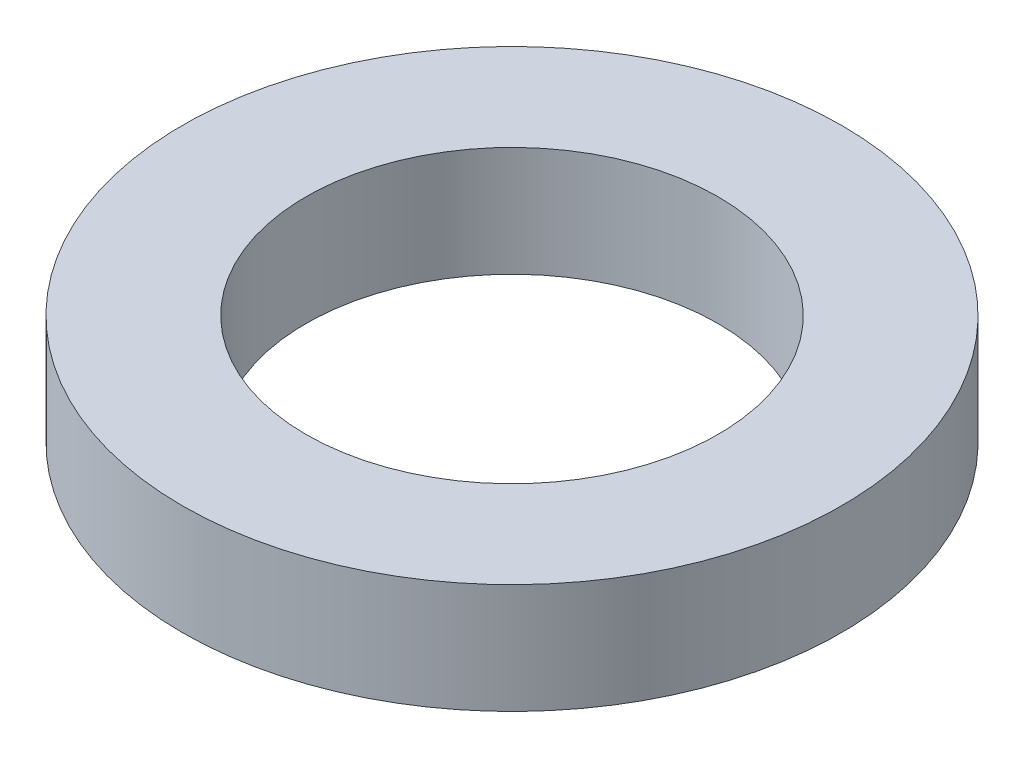
ISO-10303-21;
HEADER;
FILE_DESCRIPTION(('STEP AP214'),'2;1');
FILE_NAME('part.step','',(''),(''),'','','');
FILE_SCHEMA(('AUTOMOTIVE_DESIGN { 1 0 10303 214 1 1 1 1 }'));
ENDSEC;
DATA;
#1=APPLICATION_CONTEXT('core data for automotive mechanical design processes');
#2=APPLICATION_PROTOCOL_DEFINITION('international standard','automotive_design',2000,#1);
#3=PRODUCT_CONTEXT('',#1,'mechanical');
#4=PRODUCT('Part','Part','',(#3));
#5=PRODUCT_RELATED_PRODUCT_CATEGORY('part','',(#4));
#6=PRODUCT_DEFINITION_FORMATION('','',#4);
#7=PRODUCT_DEFINITION_CONTEXT('part definition',#1,'design');
#8=PRODUCT_DEFINITION('design','',#6,#7);
#9=PRODUCT_DEFINITION_SHAPE('','',#8);
#10=(LENGTH_UNIT() NAMED_UNIT(*) SI_UNIT(.MILLI.,.METRE.));
#11=(NAMED_UNIT(*) PLANE_ANGLE_UNIT() SI_UNIT($,.RADIAN.));
#12=(NAMED_UNIT(*) SI_UNIT($,.STERADIAN.) SOLID_ANGLE_UNIT());
#13=UNCERTAINTY_MEASURE_WITH_UNIT(LENGTH_MEASURE(1.E-05),#10,'distance_accuracy_value','');
#14=(GEOMETRIC_REPRESENTATION_CONTEXT(3) GLOBAL_UNCERTAINTY_ASSIGNED_CONTEXT((#13)) GLOBAL_UNIT_ASSIGNED_CONTEXT((#10,
#11,#12)) REPRESENTATION_CONTEXT('',''));
#15=CARTESIAN_POINT('',(0.,0.,0.));
#16=DIRECTION('',(0.,0.,1.));
#17=DIRECTION('',(1.,0.,0.));
#18=AXIS2_PLACEMENT_3D('',#15,#16,#17);
#19=CARTESIAN_POINT('',(0.,2.,0.));
#20=DIRECTION('',(0.,1.,0.));
#21=DIRECTION('',(0.,0.,1.));
#22=AXIS2_PLACEMENT_3D('',#19,#20,#21);
#23=PLANE('',#22);
#24=CARTESIAN_POINT('',(0.,2.,0.));
#25=DIRECTION('',(0.,1.,0.));
#26=DIRECTION('',(0.,0.,1.));
#27=AXIS2_PLACEMENT_3D('',#24,#25,#26);
#28=CIRCLE('',#27,6.);
#29=CARTESIAN_POINT('',(0.,2.,6.));
#30=VERTEX_POINT('',#29);
#31=EDGE_CURVE('E10',#30,#30,#28,.T.);
#32=ORIENTED_EDGE('',*,*,#31,.T.);
#33=EDGE_LOOP('',(#32));
#34=FACE_BOUND('',#33,.T.);
#35=CARTESIAN_POINT('',(0.,2.,0.));
#36=DIRECTION('',(0.,1.,0.));
#37=DIRECTION('',(0.,0.,1.));
#38=AXIS2_PLACEMENT_3D('',#35,#36,#37);
#39=CIRCLE('',#38,3.75);
#40=CARTESIAN_POINT('',(0.,2.,3.75));
#41=VERTEX_POINT('',#40);
#42=EDGE_CURVE('E42',#41,#41,#39,.T.);
#43=ORIENTED_EDGE('',*,*,#42,.F.);
#44=EDGE_LOOP('',(#43));
#45=FACE_BOUND('',#44,.T.);
#46=ADVANCED_FACE('F31',(#34,#45),#23,.T.);
#47=CARTESIAN_POINT('',(0.,0.,0.));
#48=DIRECTION('',(0.,1.,0.));
#49=DIRECTION('',(0.,0.,1.));
#50=AXIS2_PLACEMENT_3D('',#47,#48,#49);
#51=PLANE('',#50);
#52=CARTESIAN_POINT('',(0.,0.,0.));
#53=DIRECTION('',(0.,1.,0.));
#54=DIRECTION('',(0.,0.,1.));
#55=AXIS2_PLACEMENT_3D('',#52,#53,#54);
#56=CIRCLE('',#55,6.);
#57=CARTESIAN_POINT('',(0.,0.,6.));
#58=VERTEX_POINT('',#57);
#59=EDGE_CURVE('E35',#58,#58,#56,.T.);
#60=ORIENTED_EDGE('',*,*,#59,.F.);
#61=EDGE_LOOP('',(#60));
#62=FACE_BOUND('',#61,.T.);
#63=CARTESIAN_POINT('',(0.,0.,0.));
#64=DIRECTION('',(0.,1.,0.));
#65=DIRECTION('',(0.,0.,1.));
#66=AXIS2_PLACEMENT_3D('',#63,#64,#65);
#67=CIRCLE('',#66,3.75);
#68=CARTESIAN_POINT('',(0.,0.,3.75));
#69=VERTEX_POINT('',#68);
#70=EDGE_CURVE('E44',#69,#69,#67,.T.);
#71=ORIENTED_EDGE('',*,*,#70,.T.);
#72=EDGE_LOOP('',(#71));
#73=FACE_BOUND('',#72,.T.);
#74=ADVANCED_FACE('F54',(#62,#73),#51,.F.);
#75=CARTESIAN_POINT('',(0.,2.,0.));
#76=DIRECTION('',(0.,-1.,0.));
#77=DIRECTION('',(0.,0.,-1.));
#78=AXIS2_PLACEMENT_3D('',#75,#76,#77);
#79=CYLINDRICAL_SURFACE('',#78,6.);
#80=ORIENTED_EDGE('',*,*,#31,.F.);
#81=EDGE_LOOP('',(#80));
#82=FACE_BOUND('',#81,.T.);
#83=ORIENTED_EDGE('',*,*,#59,.T.);
#84=EDGE_LOOP('',(#83));
#85=FACE_BOUND('',#84,.T.);
#86=ADVANCED_FACE('F33',(#82,#85),#79,.T.);
#87=CARTESIAN_POINT('',(0.,2.,0.));
#88=DIRECTION('',(0.,-1.,0.));
#89=DIRECTION('',(0.,0.,-1.));
#90=AXIS2_PLACEMENT_3D('',#87,#88,#89);
#91=CYLINDRICAL_SURFACE('',#90,3.75);
#92=ORIENTED_EDGE('',*,*,#42,.T.);
#93=EDGE_LOOP('',(#92));
#94=FACE_BOUND('',#93,.T.);
#95=ORIENTED_EDGE('',*,*,#70,.F.);
#96=EDGE_LOOP('',(#95));
#97=FACE_BOUND('',#96,.T.);
#98=ADVANCED_FACE('F50',(#94,#97),#91,.F.);
#99=CLOSED_SHELL('',(#46,#74,#86,#98));
#100=MANIFOLD_SOLID_BREP('B2',#99);
#101=ADVANCED_BREP_SHAPE_REPRESENTATION('',(#18,#100),#14);
#102=SHAPE_DEFINITION_REPRESENTATION(#9,#101);
ENDSEC;
END-ISO-10303-21;
